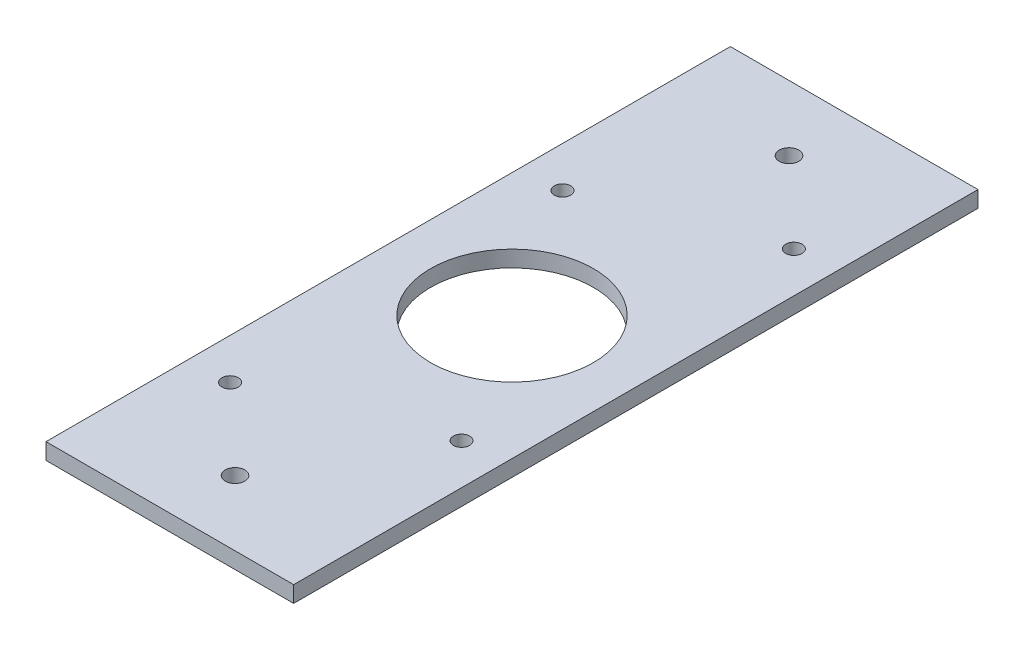
ISO-10303-21;
HEADER;
FILE_DESCRIPTION(('STEP AP214'),'2;1');
FILE_NAME('part.step','',(''),(''),'','','');
FILE_SCHEMA(('AUTOMOTIVE_DESIGN { 1 0 10303 214 1 1 1 1 }'));
ENDSEC;
DATA;
#1=APPLICATION_CONTEXT('core data for automotive mechanical design processes');
#2=APPLICATION_PROTOCOL_DEFINITION('international standard','automotive_design',2000,#1);
#3=PRODUCT_CONTEXT('',#1,'mechanical');
#4=PRODUCT('Part','Part','',(#3));
#5=PRODUCT_RELATED_PRODUCT_CATEGORY('part','',(#4));
#6=PRODUCT_DEFINITION_FORMATION('','',#4);
#7=PRODUCT_DEFINITION_CONTEXT('part definition',#1,'design');
#8=PRODUCT_DEFINITION('design','',#6,#7);
#9=PRODUCT_DEFINITION_SHAPE('','',#8);
#10=(LENGTH_UNIT() NAMED_UNIT(*) SI_UNIT(.MILLI.,.METRE.));
#11=(NAMED_UNIT(*) PLANE_ANGLE_UNIT() SI_UNIT($,.RADIAN.));
#12=(NAMED_UNIT(*) SI_UNIT($,.STERADIAN.) SOLID_ANGLE_UNIT());
#13=UNCERTAINTY_MEASURE_WITH_UNIT(LENGTH_MEASURE(1.E-05),#10,'distance_accuracy_value','');
#14=(GEOMETRIC_REPRESENTATION_CONTEXT(3) GLOBAL_UNCERTAINTY_ASSIGNED_CONTEXT((#13)) GLOBAL_UNIT_ASSIGNED_CONTEXT((#10,
#11,#12)) REPRESENTATION_CONTEXT('',''));
#15=CARTESIAN_POINT('',(0.,0.,0.));
#16=DIRECTION('',(0.,0.,1.));
#17=DIRECTION('',(1.,0.,0.));
#18=AXIS2_PLACEMENT_3D('',#15,#16,#17);
#19=CARTESIAN_POINT('',(0.,5.,0.));
#20=DIRECTION('',(0.,-1.,0.));
#21=DIRECTION('',(0.,0.,-1.));
#22=AXIS2_PLACEMENT_3D('',#19,#20,#21);
#23=PLANE('',#22);
#24=DIRECTION('',(0.,0.,-1.));
#25=VECTOR('',#24,1.);
#26=CARTESIAN_POINT('',(6.97379408339889,5.,111.39064));
#27=LINE('',#26,#25);
#28=CARTESIAN_POINT('',(6.97379408339889,5.,111.39064));
#29=VERTEX_POINT('',#28);
#30=CARTESIAN_POINT('',(6.97379408339889,5.,-98.60936));
#31=VERTEX_POINT('',#30);
#32=EDGE_CURVE('E96',#29,#31,#27,.T.);
#33=ORIENTED_EDGE('',*,*,#32,.T.);
#34=DIRECTION('',(-1.,0.,0.));
#35=VECTOR('',#34,1.);
#36=CARTESIAN_POINT('',(-69.0262059166011,5.,-98.60936));
#37=LINE('',#36,#35);
#38=CARTESIAN_POINT('',(-69.0262059166011,5.,-98.60936));
#39=VERTEX_POINT('',#38);
#40=EDGE_CURVE('E91',#31,#39,#37,.T.);
#41=ORIENTED_EDGE('',*,*,#40,.T.);
#42=DIRECTION('',(0.,0.,1.));
#43=VECTOR('',#42,1.);
#44=CARTESIAN_POINT('',(-69.0262059166011,5.,111.39064));
#45=LINE('',#44,#43);
#46=CARTESIAN_POINT('',(-69.0262059166011,5.,111.39064));
#47=VERTEX_POINT('',#46);
#48=EDGE_CURVE('E94',#39,#47,#45,.T.);
#49=ORIENTED_EDGE('',*,*,#48,.T.);
#50=DIRECTION('',(1.,0.,0.));
#51=VECTOR('',#50,1.);
#52=CARTESIAN_POINT('',(-69.0262059166011,5.,111.39064));
#53=LINE('',#52,#51);
#54=EDGE_CURVE('E61',#47,#29,#53,.T.);
#55=ORIENTED_EDGE('',*,*,#54,.T.);
#56=EDGE_LOOP('',(#33,#41,#49,#55));
#57=FACE_BOUND('',#56,.T.);
#58=CARTESIAN_POINT('',(-31.0262059166011,5.,-78.60936));
#59=DIRECTION('',(0.,1.,0.));
#60=DIRECTION('',(0.,0.,1.));
#61=AXIS2_PLACEMENT_3D('',#58,#59,#60);
#62=CIRCLE('',#61,2.99999999999999);
#63=CARTESIAN_POINT('',(-31.0262059166011,5.,-75.60936));
#64=VERTEX_POINT('',#63);
#65=EDGE_CURVE('E116',#64,#64,#62,.T.);
#66=ORIENTED_EDGE('',*,*,#65,.F.);
#67=EDGE_LOOP('',(#66));
#68=FACE_BOUND('',#67,.T.);
#69=CARTESIAN_POINT('',(-31.0262059166011,5.,91.39064));
#70=DIRECTION('',(0.,1.,0.));
#71=DIRECTION('',(0.,0.,-1.));
#72=AXIS2_PLACEMENT_3D('',#69,#70,#71);
#73=CIRCLE('',#72,2.99999999999999);
#74=CARTESIAN_POINT('',(-31.0262059166011,5.,88.39064));
#75=VERTEX_POINT('',#74);
#76=EDGE_CURVE('E138',#75,#75,#73,.T.);
#77=ORIENTED_EDGE('',*,*,#76,.F.);
#78=EDGE_LOOP('',(#77));
#79=FACE_BOUND('',#78,.T.);
#80=CARTESIAN_POINT('',(-56.5262059166011,5.,-34.60936));
#81=DIRECTION('',(0.,1.,0.));
#82=DIRECTION('',(0.,0.,1.));
#83=AXIS2_PLACEMENT_3D('',#80,#81,#82);
#84=CIRCLE('',#83,2.5);
#85=CARTESIAN_POINT('',(-56.5262059166011,5.,-32.10936));
#86=VERTEX_POINT('',#85);
#87=EDGE_CURVE('E146',#86,#86,#84,.T.);
#88=ORIENTED_EDGE('',*,*,#87,.F.);
#89=EDGE_LOOP('',(#88));
#90=FACE_BOUND('',#89,.T.);
#91=CARTESIAN_POINT('',(-5.52620591660108,5.,-54.60936));
#92=DIRECTION('',(0.,1.,0.));
#93=DIRECTION('',(0.,0.,1.));
#94=AXIS2_PLACEMENT_3D('',#91,#92,#93);
#95=CIRCLE('',#94,2.5);
#96=CARTESIAN_POINT('',(-5.52620591660108,5.,-52.10936));
#97=VERTEX_POINT('',#96);
#98=EDGE_CURVE('E154',#97,#97,#95,.T.);
#99=ORIENTED_EDGE('',*,*,#98,.F.);
#100=EDGE_LOOP('',(#99));
#101=FACE_BOUND('',#100,.T.);
#102=CARTESIAN_POINT('',(-56.5262059166011,5.,67.39064));
#103=DIRECTION('',(0.,1.,0.));
#104=DIRECTION('',(0.,0.,1.));
#105=AXIS2_PLACEMENT_3D('',#102,#103,#104);
#106=CIRCLE('',#105,2.5);
#107=CARTESIAN_POINT('',(-56.5262059166011,5.,69.89064));
#108=VERTEX_POINT('',#107);
#109=EDGE_CURVE('E162',#108,#108,#106,.T.);
#110=ORIENTED_EDGE('',*,*,#109,.F.);
#111=EDGE_LOOP('',(#110));
#112=FACE_BOUND('',#111,.T.);
#113=CARTESIAN_POINT('',(-5.52620591660108,5.,47.39064));
#114=DIRECTION('',(0.,1.,0.));
#115=DIRECTION('',(0.,0.,1.));
#116=AXIS2_PLACEMENT_3D('',#113,#114,#115);
#117=CIRCLE('',#116,2.5);
#118=CARTESIAN_POINT('',(-5.52620591660108,5.,49.89064));
#119=VERTEX_POINT('',#118);
#120=EDGE_CURVE('E170',#119,#119,#117,.T.);
#121=ORIENTED_EDGE('',*,*,#120,.F.);
#122=EDGE_LOOP('',(#121));
#123=FACE_BOUND('',#122,.T.);
#124=CARTESIAN_POINT('',(-31.0262059166011,5.,6.39063999999999));
#125=DIRECTION('',(0.,1.,0.));
#126=DIRECTION('',(0.,0.,1.));
#127=AXIS2_PLACEMENT_3D('',#124,#125,#126);
#128=CIRCLE('',#127,25.);
#129=CARTESIAN_POINT('',(-31.0262059166011,5.,31.39064));
#130=VERTEX_POINT('',#129);
#131=EDGE_CURVE('E178',#130,#130,#128,.T.);
#132=ORIENTED_EDGE('',*,*,#131,.F.);
#133=EDGE_LOOP('',(#132));
#134=FACE_BOUND('',#133,.T.);
#135=ADVANCED_FACE('F43',(#57,#68,#79,#90,#101,#112,#123,#134),#23,.F.);
#136=CARTESIAN_POINT('',(0.,0.,0.));
#137=DIRECTION('',(0.,-1.,0.));
#138=DIRECTION('',(0.,0.,-1.));
#139=AXIS2_PLACEMENT_3D('',#136,#137,#138);
#140=PLANE('',#139);
#141=CARTESIAN_POINT('',(-5.52620591660108,0.,47.39064));
#142=DIRECTION('',(0.,1.,0.));
#143=DIRECTION('',(0.,0.,1.));
#144=AXIS2_PLACEMENT_3D('',#141,#142,#143);
#145=CIRCLE('',#144,2.5);
#146=CARTESIAN_POINT('',(-5.52620591660108,0.,49.89064));
#147=VERTEX_POINT('',#146);
#148=EDGE_CURVE('E174',#147,#147,#145,.T.);
#149=ORIENTED_EDGE('',*,*,#148,.T.);
#150=EDGE_LOOP('',(#149));
#151=FACE_BOUND('',#150,.T.);
#152=CARTESIAN_POINT('',(-5.52620591660108,0.,-54.60936));
#153=DIRECTION('',(0.,1.,0.));
#154=DIRECTION('',(0.,0.,1.));
#155=AXIS2_PLACEMENT_3D('',#152,#153,#154);
#156=CIRCLE('',#155,2.5);
#157=CARTESIAN_POINT('',(-5.52620591660108,0.,-52.10936));
#158=VERTEX_POINT('',#157);
#159=EDGE_CURVE('E158',#158,#158,#156,.T.);
#160=ORIENTED_EDGE('',*,*,#159,.T.);
#161=EDGE_LOOP('',(#160));
#162=FACE_BOUND('',#161,.T.);
#163=CARTESIAN_POINT('',(-31.0262059166011,0.,91.39064));
#164=DIRECTION('',(0.,1.,0.));
#165=DIRECTION('',(0.,0.,-1.));
#166=AXIS2_PLACEMENT_3D('',#163,#164,#165);
#167=CIRCLE('',#166,2.99999999999999);
#168=CARTESIAN_POINT('',(-31.0262059166011,0.,88.39064));
#169=VERTEX_POINT('',#168);
#170=EDGE_CURVE('E142',#169,#169,#167,.T.);
#171=ORIENTED_EDGE('',*,*,#170,.T.);
#172=EDGE_LOOP('',(#171));
#173=FACE_BOUND('',#172,.T.);
#174=DIRECTION('',(0.,0.,-1.));
#175=VECTOR('',#174,1.);
#176=CARTESIAN_POINT('',(6.97379408339889,0.,111.39064));
#177=LINE('',#176,#175);
#178=CARTESIAN_POINT('',(6.97379408339889,0.,111.39064));
#179=VERTEX_POINT('',#178);
#180=CARTESIAN_POINT('',(6.97379408339889,0.,-98.60936));
#181=VERTEX_POINT('',#180);
#182=EDGE_CURVE('E112',#179,#181,#177,.T.);
#183=ORIENTED_EDGE('',*,*,#182,.F.);
#184=DIRECTION('',(1.,0.,0.));
#185=VECTOR('',#184,1.);
#186=CARTESIAN_POINT('',(-69.0262059166011,0.,111.39064));
#187=LINE('',#186,#185);
#188=CARTESIAN_POINT('',(-69.0262059166011,0.,111.39064));
#189=VERTEX_POINT('',#188);
#190=EDGE_CURVE('E84',#189,#179,#187,.T.);
#191=ORIENTED_EDGE('',*,*,#190,.F.);
#192=DIRECTION('',(0.,0.,1.));
#193=VECTOR('',#192,1.);
#194=CARTESIAN_POINT('',(-69.0262059166011,0.,111.39064));
#195=LINE('',#194,#193);
#196=CARTESIAN_POINT('',(-69.0262059166011,0.,-98.60936));
#197=VERTEX_POINT('',#196);
#198=EDGE_CURVE('E78',#197,#189,#195,.T.);
#199=ORIENTED_EDGE('',*,*,#198,.F.);
#200=DIRECTION('',(-1.,0.,0.));
#201=VECTOR('',#200,1.);
#202=CARTESIAN_POINT('',(-69.0262059166011,0.,-98.60936));
#203=LINE('',#202,#201);
#204=EDGE_CURVE('E101',#181,#197,#203,.T.);
#205=ORIENTED_EDGE('',*,*,#204,.F.);
#206=EDGE_LOOP('',(#183,#191,#199,#205));
#207=FACE_BOUND('',#206,.T.);
#208=CARTESIAN_POINT('',(-31.0262059166011,0.,-78.60936));
#209=DIRECTION('',(0.,1.,0.));
#210=DIRECTION('',(0.,0.,1.));
#211=AXIS2_PLACEMENT_3D('',#208,#209,#210);
#212=CIRCLE('',#211,2.99999999999999);
#213=CARTESIAN_POINT('',(-31.0262059166011,0.,-75.60936));
#214=VERTEX_POINT('',#213);
#215=EDGE_CURVE('E134',#214,#214,#212,.T.);
#216=ORIENTED_EDGE('',*,*,#215,.T.);
#217=EDGE_LOOP('',(#216));
#218=FACE_BOUND('',#217,.T.);
#219=CARTESIAN_POINT('',(-56.5262059166011,0.,-34.60936));
#220=DIRECTION('',(0.,1.,0.));
#221=DIRECTION('',(0.,0.,1.));
#222=AXIS2_PLACEMENT_3D('',#219,#220,#221);
#223=CIRCLE('',#222,2.5);
#224=CARTESIAN_POINT('',(-56.5262059166011,0.,-32.10936));
#225=VERTEX_POINT('',#224);
#226=EDGE_CURVE('E150',#225,#225,#223,.T.);
#227=ORIENTED_EDGE('',*,*,#226,.T.);
#228=EDGE_LOOP('',(#227));
#229=FACE_BOUND('',#228,.T.);
#230=CARTESIAN_POINT('',(-56.5262059166011,0.,67.39064));
#231=DIRECTION('',(0.,1.,0.));
#232=DIRECTION('',(0.,0.,1.));
#233=AXIS2_PLACEMENT_3D('',#230,#231,#232);
#234=CIRCLE('',#233,2.5);
#235=CARTESIAN_POINT('',(-56.5262059166011,0.,69.89064));
#236=VERTEX_POINT('',#235);
#237=EDGE_CURVE('E166',#236,#236,#234,.T.);
#238=ORIENTED_EDGE('',*,*,#237,.T.);
#239=EDGE_LOOP('',(#238));
#240=FACE_BOUND('',#239,.T.);
#241=CARTESIAN_POINT('',(-31.0262059166011,0.,6.39063999999999));
#242=DIRECTION('',(0.,1.,0.));
#243=DIRECTION('',(0.,0.,1.));
#244=AXIS2_PLACEMENT_3D('',#241,#242,#243);
#245=CIRCLE('',#244,25.);
#246=CARTESIAN_POINT('',(-31.0262059166011,0.,31.39064));
#247=VERTEX_POINT('',#246);
#248=EDGE_CURVE('E182',#247,#247,#245,.T.);
#249=ORIENTED_EDGE('',*,*,#248,.T.);
#250=EDGE_LOOP('',(#249));
#251=FACE_BOUND('',#250,.T.);
#252=ADVANCED_FACE('F129',(#151,#162,#173,#207,#218,#229,#240,#251),#140,.T.);
#253=CARTESIAN_POINT('',(6.97379408339889,5.,111.39064));
#254=DIRECTION('',(-1.,0.,0.));
#255=DIRECTION('',(0.,0.,1.));
#256=AXIS2_PLACEMENT_3D('',#253,#254,#255);
#257=PLANE('',#256);
#258=ORIENTED_EDGE('',*,*,#182,.T.);
#259=DIRECTION('',(0.,-1.,0.));
#260=VECTOR('',#259,1.);
#261=CARTESIAN_POINT('',(6.97379408339889,5.,-98.60936));
#262=LINE('',#261,#260);
#263=EDGE_CURVE('E11',#31,#181,#262,.T.);
#264=ORIENTED_EDGE('',*,*,#263,.F.);
#265=ORIENTED_EDGE('',*,*,#32,.F.);
#266=DIRECTION('',(0.,-1.,0.));
#267=VECTOR('',#266,1.);
#268=CARTESIAN_POINT('',(6.97379408339889,5.,111.39064));
#269=LINE('',#268,#267);
#270=EDGE_CURVE('E108',#29,#179,#269,.T.);
#271=ORIENTED_EDGE('',*,*,#270,.T.);
#272=EDGE_LOOP('',(#258,#264,#265,#271));
#273=FACE_BOUND('',#272,.T.);
#274=ADVANCED_FACE('F45',(#273),#257,.F.);
#275=CARTESIAN_POINT('',(-69.0262059166011,5.,-98.60936));
#276=DIRECTION('',(0.,0.,1.));
#277=DIRECTION('',(1.,0.,0.));
#278=AXIS2_PLACEMENT_3D('',#275,#276,#277);
#279=PLANE('',#278);
#280=ORIENTED_EDGE('',*,*,#204,.T.);
#281=DIRECTION('',(0.,-1.,0.));
#282=VECTOR('',#281,1.);
#283=CARTESIAN_POINT('',(-69.0262059166011,5.,-98.60936));
#284=LINE('',#283,#282);
#285=EDGE_CURVE('E53',#39,#197,#284,.T.);
#286=ORIENTED_EDGE('',*,*,#285,.F.);
#287=ORIENTED_EDGE('',*,*,#40,.F.);
#288=ORIENTED_EDGE('',*,*,#263,.T.);
#289=EDGE_LOOP('',(#280,#286,#287,#288));
#290=FACE_BOUND('',#289,.T.);
#291=ADVANCED_FACE('F100',(#290),#279,.F.);
#292=CARTESIAN_POINT('',(-69.0262059166011,5.,111.39064));
#293=DIRECTION('',(1.,0.,0.));
#294=DIRECTION('',(0.,0.,-1.));
#295=AXIS2_PLACEMENT_3D('',#292,#293,#294);
#296=PLANE('',#295);
#297=ORIENTED_EDGE('',*,*,#198,.T.);
#298=DIRECTION('',(0.,-1.,0.));
#299=VECTOR('',#298,1.);
#300=CARTESIAN_POINT('',(-69.0262059166011,5.,111.39064));
#301=LINE('',#300,#299);
#302=EDGE_CURVE('E103',#47,#189,#301,.T.);
#303=ORIENTED_EDGE('',*,*,#302,.F.);
#304=ORIENTED_EDGE('',*,*,#48,.F.);
#305=ORIENTED_EDGE('',*,*,#285,.T.);
#306=EDGE_LOOP('',(#297,#303,#304,#305));
#307=FACE_BOUND('',#306,.T.);
#308=ADVANCED_FACE('F104',(#307),#296,.F.);
#309=CARTESIAN_POINT('',(-69.0262059166011,5.,111.39064));
#310=DIRECTION('',(0.,0.,-1.));
#311=DIRECTION('',(-1.,0.,0.));
#312=AXIS2_PLACEMENT_3D('',#309,#310,#311);
#313=PLANE('',#312);
#314=ORIENTED_EDGE('',*,*,#190,.T.);
#315=ORIENTED_EDGE('',*,*,#270,.F.);
#316=ORIENTED_EDGE('',*,*,#54,.F.);
#317=ORIENTED_EDGE('',*,*,#302,.T.);
#318=EDGE_LOOP('',(#314,#315,#316,#317));
#319=FACE_BOUND('',#318,.T.);
#320=ADVANCED_FACE('F126',(#319),#313,.F.);
#321=CARTESIAN_POINT('',(-31.0262059166011,5.,-78.60936));
#322=DIRECTION('',(0.,-1.,0.));
#323=DIRECTION('',(0.,0.,-1.));
#324=AXIS2_PLACEMENT_3D('',#321,#322,#323);
#325=CYLINDRICAL_SURFACE('',#324,2.99999999999999);
#326=ORIENTED_EDGE('',*,*,#65,.T.);
#327=EDGE_LOOP('',(#326));
#328=FACE_BOUND('',#327,.T.);
#329=ORIENTED_EDGE('',*,*,#215,.F.);
#330=EDGE_LOOP('',(#329));
#331=FACE_BOUND('',#330,.T.);
#332=ADVANCED_FACE('F201',(#328,#331),#325,.F.);
#333=CARTESIAN_POINT('',(-31.0262059166011,5.,91.39064));
#334=DIRECTION('',(0.,-1.,0.));
#335=DIRECTION('',(0.,0.,-1.));
#336=AXIS2_PLACEMENT_3D('',#333,#334,#335);
#337=CYLINDRICAL_SURFACE('',#336,2.99999999999999);
#338=ORIENTED_EDGE('',*,*,#76,.T.);
#339=EDGE_LOOP('',(#338));
#340=FACE_BOUND('',#339,.T.);
#341=ORIENTED_EDGE('',*,*,#170,.F.);
#342=EDGE_LOOP('',(#341));
#343=FACE_BOUND('',#342,.T.);
#344=ADVANCED_FACE('F255',(#340,#343),#337,.F.);
#345=CARTESIAN_POINT('',(-56.5262059166011,5.,-34.60936));
#346=DIRECTION('',(0.,-1.,0.));
#347=DIRECTION('',(0.,0.,-1.));
#348=AXIS2_PLACEMENT_3D('',#345,#346,#347);
#349=CYLINDRICAL_SURFACE('',#348,2.5);
#350=ORIENTED_EDGE('',*,*,#87,.T.);
#351=EDGE_LOOP('',(#350));
#352=FACE_BOUND('',#351,.T.);
#353=ORIENTED_EDGE('',*,*,#226,.F.);
#354=EDGE_LOOP('',(#353));
#355=FACE_BOUND('',#354,.T.);
#356=ADVANCED_FACE('F264',(#352,#355),#349,.F.);
#357=CARTESIAN_POINT('',(-5.52620591660108,5.,-54.60936));
#358=DIRECTION('',(0.,-1.,0.));
#359=DIRECTION('',(0.,0.,-1.));
#360=AXIS2_PLACEMENT_3D('',#357,#358,#359);
#361=CYLINDRICAL_SURFACE('',#360,2.5);
#362=ORIENTED_EDGE('',*,*,#98,.T.);
#363=EDGE_LOOP('',(#362));
#364=FACE_BOUND('',#363,.T.);
#365=ORIENTED_EDGE('',*,*,#159,.F.);
#366=EDGE_LOOP('',(#365));
#367=FACE_BOUND('',#366,.T.);
#368=ADVANCED_FACE('F273',(#364,#367),#361,.F.);
#369=CARTESIAN_POINT('',(-56.5262059166011,5.,67.39064));
#370=DIRECTION('',(0.,-1.,0.));
#371=DIRECTION('',(0.,0.,-1.));
#372=AXIS2_PLACEMENT_3D('',#369,#370,#371);
#373=CYLINDRICAL_SURFACE('',#372,2.5);
#374=ORIENTED_EDGE('',*,*,#109,.T.);
#375=EDGE_LOOP('',(#374));
#376=FACE_BOUND('',#375,.T.);
#377=ORIENTED_EDGE('',*,*,#237,.F.);
#378=EDGE_LOOP('',(#377));
#379=FACE_BOUND('',#378,.T.);
#380=ADVANCED_FACE('F283',(#376,#379),#373,.F.);
#381=CARTESIAN_POINT('',(-5.52620591660108,5.,47.39064));
#382=DIRECTION('',(0.,-1.,0.));
#383=DIRECTION('',(0.,0.,-1.));
#384=AXIS2_PLACEMENT_3D('',#381,#382,#383);
#385=CYLINDRICAL_SURFACE('',#384,2.5);
#386=ORIENTED_EDGE('',*,*,#120,.T.);
#387=EDGE_LOOP('',(#386));
#388=FACE_BOUND('',#387,.T.);
#389=ORIENTED_EDGE('',*,*,#148,.F.);
#390=EDGE_LOOP('',(#389));
#391=FACE_BOUND('',#390,.T.);
#392=ADVANCED_FACE('F293',(#388,#391),#385,.F.);
#393=CARTESIAN_POINT('',(-31.0262059166011,5.,6.39063999999999));
#394=DIRECTION('',(0.,-1.,0.));
#395=DIRECTION('',(0.,0.,-1.));
#396=AXIS2_PLACEMENT_3D('',#393,#394,#395);
#397=CYLINDRICAL_SURFACE('',#396,25.);
#398=ORIENTED_EDGE('',*,*,#131,.T.);
#399=EDGE_LOOP('',(#398));
#400=FACE_BOUND('',#399,.T.);
#401=ORIENTED_EDGE('',*,*,#248,.F.);
#402=EDGE_LOOP('',(#401));
#403=FACE_BOUND('',#402,.T.);
#404=ADVANCED_FACE('F190',(#400,#403),#397,.F.);
#405=CLOSED_SHELL('',(#135,#252,#274,#291,#308,#320,#332,#344,#356,#368,#380,#392,#404));
#406=MANIFOLD_SOLID_BREP('B2',#405);
#407=ADVANCED_BREP_SHAPE_REPRESENTATION('',(#18,#406),#14);
#408=SHAPE_DEFINITION_REPRESENTATION(#9,#407);
ENDSEC;
END-ISO-10303-21;
